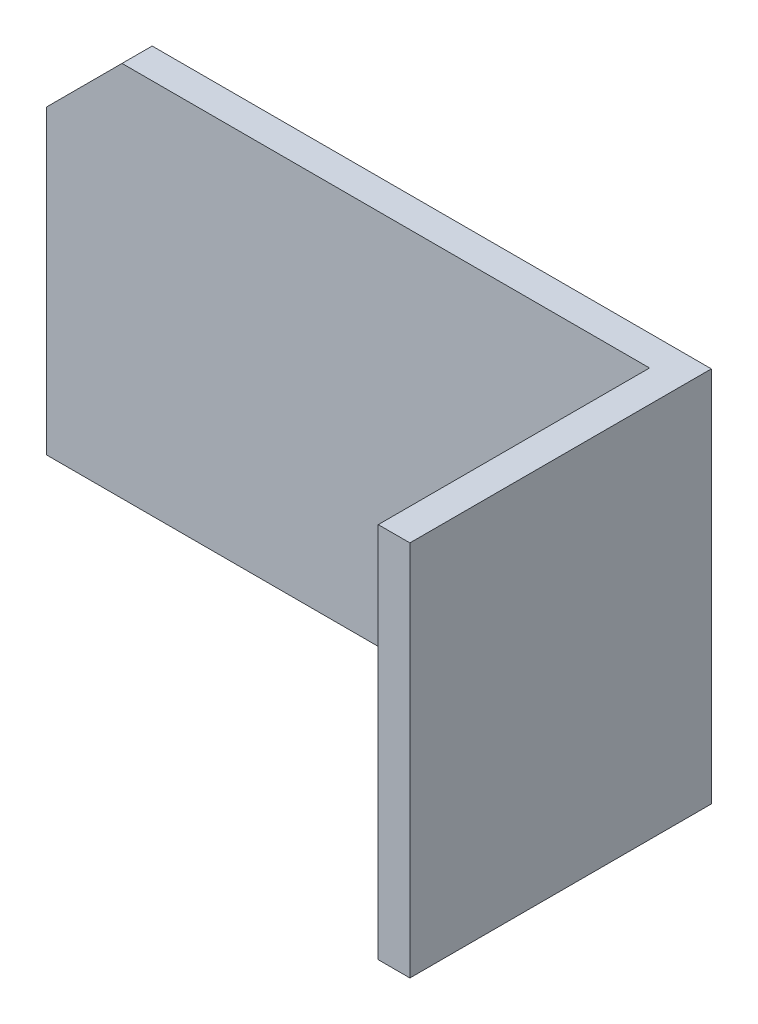
ISO-10303-21;
HEADER;
FILE_DESCRIPTION(('STEP AP214'),'2;1');
FILE_NAME('part.step','',(''),(''),'','','');
FILE_SCHEMA(('AUTOMOTIVE_DESIGN { 1 0 10303 214 1 1 1 1 }'));
ENDSEC;
DATA;
#1=APPLICATION_CONTEXT('core data for automotive mechanical design processes');
#2=APPLICATION_PROTOCOL_DEFINITION('international standard','automotive_design',2000,#1);
#3=PRODUCT_CONTEXT('',#1,'mechanical');
#4=PRODUCT('Part','Part','',(#3));
#5=PRODUCT_RELATED_PRODUCT_CATEGORY('part','',(#4));
#6=PRODUCT_DEFINITION_FORMATION('','',#4);
#7=PRODUCT_DEFINITION_CONTEXT('part definition',#1,'design');
#8=PRODUCT_DEFINITION('design','',#6,#7);
#9=PRODUCT_DEFINITION_SHAPE('','',#8);
#10=(LENGTH_UNIT() NAMED_UNIT(*) SI_UNIT(.MILLI.,.METRE.));
#11=(NAMED_UNIT(*) PLANE_ANGLE_UNIT() SI_UNIT($,.RADIAN.));
#12=(NAMED_UNIT(*) SI_UNIT($,.STERADIAN.) SOLID_ANGLE_UNIT());
#13=UNCERTAINTY_MEASURE_WITH_UNIT(LENGTH_MEASURE(1.E-05),#10,'distance_accuracy_value','');
#14=(GEOMETRIC_REPRESENTATION_CONTEXT(3) GLOBAL_UNCERTAINTY_ASSIGNED_CONTEXT((#13)) GLOBAL_UNIT_ASSIGNED_CONTEXT((#10,
#11,#12)) REPRESENTATION_CONTEXT('',''));
#15=CARTESIAN_POINT('',(0.,0.,0.));
#16=DIRECTION('',(0.,0.,1.));
#17=DIRECTION('',(1.,0.,0.));
#18=AXIS2_PLACEMENT_3D('',#15,#16,#17);
#19=CARTESIAN_POINT('',(1.48217930040456,0.75,0.2));
#20=DIRECTION('',(0.,0.,1.));
#21=DIRECTION('',(1.,0.,0.));
#22=AXIS2_PLACEMENT_3D('',#19,#20,#21);
#23=PLANE('',#22);
#24=DIRECTION('',(0.,-1.,0.));
#25=VECTOR('',#24,1.);
#26=CARTESIAN_POINT('',(1.49267930040456,0.75,0.2));
#27=LINE('',#26,#25);
#28=CARTESIAN_POINT('',(1.49267930040456,0.875,0.2));
#29=VERTEX_POINT('',#28);
#30=CARTESIAN_POINT('',(1.49267930040456,0.625,0.2));
#31=VERTEX_POINT('',#30);
#32=EDGE_CURVE('E132',#29,#31,#27,.T.);
#33=ORIENTED_EDGE('',*,*,#32,.F.);
#34=DIRECTION('',(1.,0.,0.));
#35=VECTOR('',#34,1.);
#36=CARTESIAN_POINT('',(1.36234567518565,0.875,0.2));
#37=LINE('',#36,#35);
#38=CARTESIAN_POINT('',(1.47167930040457,0.875,0.2));
#39=VERTEX_POINT('',#38);
#40=EDGE_CURVE('E149',#39,#29,#37,.T.);
#41=ORIENTED_EDGE('',*,*,#40,.F.);
#42=DIRECTION('',(0.,-1.,0.));
#43=VECTOR('',#42,1.);
#44=CARTESIAN_POINT('',(1.47167930040457,0.75,0.2));
#45=LINE('',#44,#43);
#46=CARTESIAN_POINT('',(1.47167930040457,0.625,0.2));
#47=VERTEX_POINT('',#46);
#48=EDGE_CURVE('E11',#39,#47,#45,.T.);
#49=ORIENTED_EDGE('',*,*,#48,.T.);
#50=DIRECTION('',(1.,0.,0.));
#51=VECTOR('',#50,1.);
#52=CARTESIAN_POINT('',(1.34015031489732,0.625,0.2));
#53=LINE('',#52,#51);
#54=EDGE_CURVE('E110',#47,#31,#53,.T.);
#55=ORIENTED_EDGE('',*,*,#54,.T.);
#56=EDGE_LOOP('',(#33,#41,#49,#55));
#57=FACE_BOUND('',#56,.T.);
#58=ADVANCED_FACE('F16',(#57),#23,.T.);
#59=CARTESIAN_POINT('',(1.27669667488565,0.746711342510851,0.02));
#60=DIRECTION('',(0.,0.,1.));
#61=DIRECTION('',(1.,0.,0.));
#62=AXIS2_PLACEMENT_3D('',#59,#60,#61);
#63=PLANE('',#62);
#64=DIRECTION('',(0.,-1.,0.));
#65=VECTOR('',#64,1.);
#66=CARTESIAN_POINT('',(1.07167930040456,0.725,0.02));
#67=LINE('',#66,#65);
#68=CARTESIAN_POINT('',(1.07167930040456,0.825,0.02));
#69=VERTEX_POINT('',#68);
#70=CARTESIAN_POINT('',(1.07167930040456,0.625,0.02));
#71=VERTEX_POINT('',#70);
#72=EDGE_CURVE('E101',#69,#71,#67,.T.);
#73=ORIENTED_EDGE('',*,*,#72,.T.);
#74=DIRECTION('',(1.,0.,0.));
#75=VECTOR('',#74,1.);
#76=CARTESIAN_POINT('',(1.34015031489732,0.625,0.02));
#77=LINE('',#76,#75);
#78=CARTESIAN_POINT('',(1.47167930040457,0.625,0.02));
#79=VERTEX_POINT('',#78);
#80=EDGE_CURVE('E98',#71,#79,#77,.T.);
#81=ORIENTED_EDGE('',*,*,#80,.T.);
#82=DIRECTION('',(0.,1.,0.));
#83=VECTOR('',#82,1.);
#84=CARTESIAN_POINT('',(1.47167930040457,0.75,0.02));
#85=LINE('',#84,#83);
#86=CARTESIAN_POINT('',(1.47167930040457,0.875,0.02));
#87=VERTEX_POINT('',#86);
#88=EDGE_CURVE('E27',#79,#87,#85,.T.);
#89=ORIENTED_EDGE('',*,*,#88,.T.);
#90=DIRECTION('',(1.,0.,0.));
#91=VECTOR('',#90,1.);
#92=CARTESIAN_POINT('',(1.36234567518565,0.875,0.02));
#93=LINE('',#92,#91);
#94=CARTESIAN_POINT('',(1.12167930040456,0.875,0.02));
#95=VERTEX_POINT('',#94);
#96=EDGE_CURVE('E133',#95,#87,#93,.T.);
#97=ORIENTED_EDGE('',*,*,#96,.F.);
#98=DIRECTION('',(-0.707106781186547,-0.707106781186548,0.));
#99=VECTOR('',#98,1.);
#100=CARTESIAN_POINT('',(1.09667930040456,0.85,0.02));
#101=LINE('',#100,#99);
#102=EDGE_CURVE('E42',#95,#69,#101,.T.);
#103=ORIENTED_EDGE('',*,*,#102,.T.);
#104=EDGE_LOOP('',(#73,#81,#89,#97,#103));
#105=FACE_BOUND('',#104,.T.);
#106=ADVANCED_FACE('F99',(#105),#63,.T.);
#107=CARTESIAN_POINT('',(1.47167930040457,0.75,0.11));
#108=DIRECTION('',(1.,0.,0.));
#109=DIRECTION('',(0.,0.,1.));
#110=AXIS2_PLACEMENT_3D('',#107,#108,#109);
#111=PLANE('',#110);
#112=DIRECTION('',(0.,0.,1.));
#113=VECTOR('',#112,1.);
#114=CARTESIAN_POINT('',(1.47167930040457,0.875,0.0448336252189136));
#115=LINE('',#114,#113);
#116=EDGE_CURVE('E93',#87,#39,#115,.T.);
#117=ORIENTED_EDGE('',*,*,#116,.F.);
#118=ORIENTED_EDGE('',*,*,#88,.F.);
#119=DIRECTION('',(0.,0.,1.));
#120=VECTOR('',#119,1.);
#121=CARTESIAN_POINT('',(1.47167930040457,0.625,0.0420289855072459));
#122=LINE('',#121,#120);
#123=EDGE_CURVE('E90',#79,#47,#122,.T.);
#124=ORIENTED_EDGE('',*,*,#123,.T.);
#125=ORIENTED_EDGE('',*,*,#48,.F.);
#126=EDGE_LOOP('',(#117,#118,#124,#125));
#127=FACE_BOUND('',#126,.T.);
#128=ADVANCED_FACE('F88',(#127),#111,.F.);
#129=CARTESIAN_POINT('',(1.09667930040456,0.85,0.01));
#130=DIRECTION('',(0.707106781186548,-0.707106781186547,0.));
#131=DIRECTION('',(0.,0.,-1.));
#132=AXIS2_PLACEMENT_3D('',#129,#130,#131);
#133=PLANE('',#132);
#134=DIRECTION('',(0.,0.,1.));
#135=VECTOR('',#134,1.);
#136=CARTESIAN_POINT('',(1.07167930040456,0.825,0.01));
#137=LINE('',#136,#135);
#138=CARTESIAN_POINT('',(1.07167930040456,0.825,0.));
#139=VERTEX_POINT('',#138);
#140=EDGE_CURVE('E146',#139,#69,#137,.T.);
#141=ORIENTED_EDGE('',*,*,#140,.T.);
#142=ORIENTED_EDGE('',*,*,#102,.F.);
#143=DIRECTION('',(0.,0.,1.));
#144=VECTOR('',#143,1.);
#145=CARTESIAN_POINT('',(1.12167930040456,0.875,0.0448336252189136));
#146=LINE('',#145,#144);
#147=CARTESIAN_POINT('',(1.12167930040456,0.875,0.));
#148=VERTEX_POINT('',#147);
#149=EDGE_CURVE('E143',#148,#95,#146,.T.);
#150=ORIENTED_EDGE('',*,*,#149,.F.);
#151=DIRECTION('',(-0.707106781186541,-0.707106781186554,0.));
#152=VECTOR('',#151,1.);
#153=CARTESIAN_POINT('',(1.12167930040456,0.875,0.));
#154=LINE('',#153,#152);
#155=EDGE_CURVE('E125',#148,#139,#154,.T.);
#156=ORIENTED_EDGE('',*,*,#155,.T.);
#157=EDGE_LOOP('',(#141,#142,#150,#156));
#158=FACE_BOUND('',#157,.T.);
#159=ADVANCED_FACE('F170',(#158),#133,.F.);
#160=CARTESIAN_POINT('',(1.07167930040456,0.725,0.01));
#161=DIRECTION('',(1.,0.,0.));
#162=DIRECTION('',(0.,0.,1.));
#163=AXIS2_PLACEMENT_3D('',#160,#161,#162);
#164=PLANE('',#163);
#165=DIRECTION('',(0.,0.,1.));
#166=VECTOR('',#165,1.);
#167=CARTESIAN_POINT('',(1.07167930040456,0.625,0.0420289855072459));
#168=LINE('',#167,#166);
#169=CARTESIAN_POINT('',(1.07167930040456,0.625,0.));
#170=VERTEX_POINT('',#169);
#171=EDGE_CURVE('E106',#170,#71,#168,.T.);
#172=ORIENTED_EDGE('',*,*,#171,.T.);
#173=ORIENTED_EDGE('',*,*,#72,.F.);
#174=ORIENTED_EDGE('',*,*,#140,.F.);
#175=DIRECTION('',(0.,-1.,0.));
#176=VECTOR('',#175,1.);
#177=CARTESIAN_POINT('',(1.07167930040456,0.746816562660918,0.));
#178=LINE('',#177,#176);
#179=EDGE_CURVE('E123',#139,#170,#178,.T.);
#180=ORIENTED_EDGE('',*,*,#179,.T.);
#181=EDGE_LOOP('',(#172,#173,#174,#180));
#182=FACE_BOUND('',#181,.T.);
#183=ADVANCED_FACE('F18',(#182),#164,.F.);
#184=CARTESIAN_POINT('',(1.34015031489732,0.625,0.0420289855072459));
#185=DIRECTION('',(0.,1.,0.));
#186=DIRECTION('',(0.,0.,-1.));
#187=AXIS2_PLACEMENT_3D('',#184,#185,#186);
#188=PLANE('',#187);
#189=DIRECTION('',(0.,0.,-1.));
#190=VECTOR('',#189,1.);
#191=CARTESIAN_POINT('',(1.49267930040456,0.625,0.0999999999999988));
#192=LINE('',#191,#190);
#193=CARTESIAN_POINT('',(1.49267930040456,0.625,0.));
#194=VERTEX_POINT('',#193);
#195=EDGE_CURVE('E118',#31,#194,#192,.T.);
#196=ORIENTED_EDGE('',*,*,#195,.F.);
#197=ORIENTED_EDGE('',*,*,#54,.F.);
#198=ORIENTED_EDGE('',*,*,#123,.F.);
#199=ORIENTED_EDGE('',*,*,#80,.F.);
#200=ORIENTED_EDGE('',*,*,#171,.F.);
#201=DIRECTION('',(1.,0.,0.));
#202=VECTOR('',#201,1.);
#203=CARTESIAN_POINT('',(1.28727042163972,0.625,0.));
#204=LINE('',#203,#202);
#205=EDGE_CURVE('E122',#170,#194,#204,.T.);
#206=ORIENTED_EDGE('',*,*,#205,.T.);
#207=EDGE_LOOP('',(#196,#197,#198,#199,#200,#206));
#208=FACE_BOUND('',#207,.T.);
#209=ADVANCED_FACE('F109',(#208),#188,.F.);
#210=CARTESIAN_POINT('',(1.49267930040456,0.75,0.0999999999999988));
#211=DIRECTION('',(1.,0.,0.));
#212=DIRECTION('',(0.,-1.,0.));
#213=AXIS2_PLACEMENT_3D('',#210,#211,#212);
#214=PLANE('',#213);
#215=ORIENTED_EDGE('',*,*,#32,.T.);
#216=ORIENTED_EDGE('',*,*,#195,.T.);
#217=DIRECTION('',(0.,1.,0.));
#218=VECTOR('',#217,1.);
#219=CARTESIAN_POINT('',(1.49267930040456,0.746816562660918,0.));
#220=LINE('',#219,#218);
#221=CARTESIAN_POINT('',(1.49267930040456,0.875,0.));
#222=VERTEX_POINT('',#221);
#223=EDGE_CURVE('E234',#194,#222,#220,.T.);
#224=ORIENTED_EDGE('',*,*,#223,.T.);
#225=DIRECTION('',(0.,0.,-1.));
#226=VECTOR('',#225,1.);
#227=CARTESIAN_POINT('',(1.49267930040456,0.875,0.0448336252189136));
#228=LINE('',#227,#226);
#229=EDGE_CURVE('E20',#29,#222,#228,.T.);
#230=ORIENTED_EDGE('',*,*,#229,.F.);
#231=EDGE_LOOP('',(#215,#216,#224,#230));
#232=FACE_BOUND('',#231,.T.);
#233=ADVANCED_FACE('F248',(#232),#214,.T.);
#234=CARTESIAN_POINT('',(1.36234567518565,0.875,0.0448336252189136));
#235=DIRECTION('',(0.,1.,0.));
#236=DIRECTION('',(1.,0.,0.));
#237=AXIS2_PLACEMENT_3D('',#234,#235,#236);
#238=PLANE('',#237);
#239=ORIENTED_EDGE('',*,*,#96,.T.);
#240=ORIENTED_EDGE('',*,*,#116,.T.);
#241=ORIENTED_EDGE('',*,*,#40,.T.);
#242=ORIENTED_EDGE('',*,*,#229,.T.);
#243=DIRECTION('',(-1.,0.,0.));
#244=VECTOR('',#243,1.);
#245=CARTESIAN_POINT('',(1.28727042163972,0.875,0.));
#246=LINE('',#245,#244);
#247=EDGE_CURVE('E135',#222,#148,#246,.T.);
#248=ORIENTED_EDGE('',*,*,#247,.T.);
#249=ORIENTED_EDGE('',*,*,#149,.T.);
#250=EDGE_LOOP('',(#239,#240,#241,#242,#248,#249));
#251=FACE_BOUND('',#250,.T.);
#252=ADVANCED_FACE('F161',(#251),#238,.T.);
#253=CARTESIAN_POINT('',(1.28727042163972,0.746816562660918,0.));
#254=DIRECTION('',(0.,0.,1.));
#255=DIRECTION('',(1.,0.,0.));
#256=AXIS2_PLACEMENT_3D('',#253,#254,#255);
#257=PLANE('',#256);
#258=ORIENTED_EDGE('',*,*,#223,.F.);
#259=ORIENTED_EDGE('',*,*,#205,.F.);
#260=ORIENTED_EDGE('',*,*,#179,.F.);
#261=ORIENTED_EDGE('',*,*,#155,.F.);
#262=ORIENTED_EDGE('',*,*,#247,.F.);
#263=EDGE_LOOP('',(#258,#259,#260,#261,#262));
#264=FACE_BOUND('',#263,.T.);
#265=ADVANCED_FACE('F167',(#264),#257,.F.);
#266=CLOSED_SHELL('',(#58,#106,#128,#159,#183,#209,#233,#252,#265));
#267=MANIFOLD_SOLID_BREP('B1',#266);
#268=ADVANCED_BREP_SHAPE_REPRESENTATION('',(#18,#267),#14);
#269=SHAPE_DEFINITION_REPRESENTATION(#9,#268);
ENDSEC;
END-ISO-10303-21;
